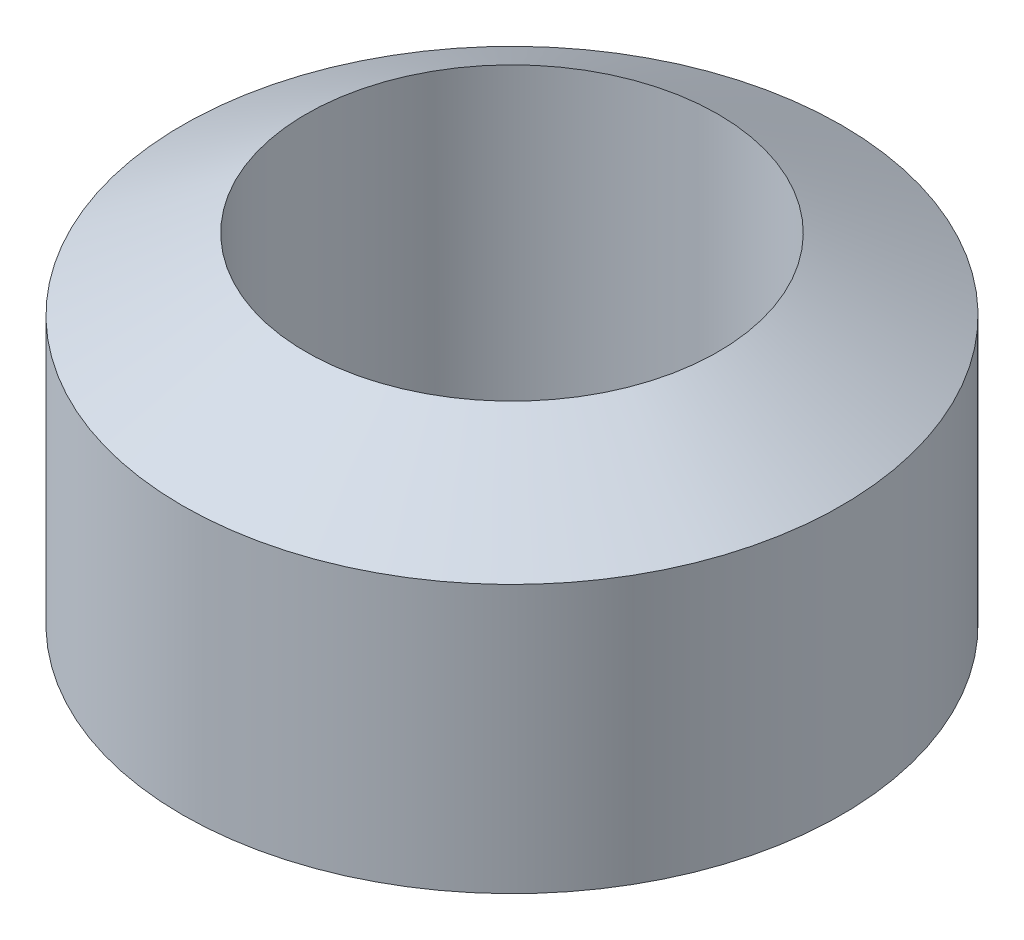
ISO-10303-21;
HEADER;
FILE_DESCRIPTION(('STEP AP214'),'2;1');
FILE_NAME('part.step','',(''),(''),'','','');
FILE_SCHEMA(('AUTOMOTIVE_DESIGN { 1 0 10303 214 1 1 1 1 }'));
ENDSEC;
DATA;
#1=APPLICATION_CONTEXT('core data for automotive mechanical design processes');
#2=APPLICATION_PROTOCOL_DEFINITION('international standard','automotive_design',2000,#1);
#3=PRODUCT_CONTEXT('',#1,'mechanical');
#4=PRODUCT('Part','Part','',(#3));
#5=PRODUCT_RELATED_PRODUCT_CATEGORY('part','',(#4));
#6=PRODUCT_DEFINITION_FORMATION('','',#4);
#7=PRODUCT_DEFINITION_CONTEXT('part definition',#1,'design');
#8=PRODUCT_DEFINITION('design','',#6,#7);
#9=PRODUCT_DEFINITION_SHAPE('','',#8);
#10=(LENGTH_UNIT() NAMED_UNIT(*) SI_UNIT(.MILLI.,.METRE.));
#11=(NAMED_UNIT(*) PLANE_ANGLE_UNIT() SI_UNIT($,.RADIAN.));
#12=(NAMED_UNIT(*) SI_UNIT($,.STERADIAN.) SOLID_ANGLE_UNIT());
#13=UNCERTAINTY_MEASURE_WITH_UNIT(LENGTH_MEASURE(1.E-05),#10,'distance_accuracy_value','');
#14=(GEOMETRIC_REPRESENTATION_CONTEXT(3) GLOBAL_UNCERTAINTY_ASSIGNED_CONTEXT((#13)) GLOBAL_UNIT_ASSIGNED_CONTEXT((#10,
#11,#12)) REPRESENTATION_CONTEXT('',''));
#15=CARTESIAN_POINT('',(0.,0.,0.));
#16=DIRECTION('',(0.,0.,1.));
#17=DIRECTION('',(1.,0.,0.));
#18=AXIS2_PLACEMENT_3D('',#15,#16,#17);
#19=CARTESIAN_POINT('',(0.,10.,0.));
#20=DIRECTION('',(0.,-1.,0.));
#21=DIRECTION('',(0.,0.,-1.));
#22=AXIS2_PLACEMENT_3D('',#19,#20,#21);
#23=CYLINDRICAL_SURFACE('',#22,8.);
#24=CARTESIAN_POINT('',(0.,1.75000000000002,0.));
#25=DIRECTION('',(0.,1.,0.));
#26=DIRECTION('',(0.,0.,1.));
#27=AXIS2_PLACEMENT_3D('',#24,#25,#26);
#28=CIRCLE('',#27,8.);
#29=CARTESIAN_POINT('',(0.,1.75000000000002,8.));
#30=VERTEX_POINT('',#29);
#31=EDGE_CURVE('E56',#30,#30,#28,.T.);
#32=ORIENTED_EDGE('',*,*,#31,.T.);
#33=EDGE_LOOP('',(#32));
#34=FACE_BOUND('',#33,.T.);
#35=CARTESIAN_POINT('',(0.,8.24999999999998,0.));
#36=DIRECTION('',(0.,1.,0.));
#37=DIRECTION('',(0.,0.,1.));
#38=AXIS2_PLACEMENT_3D('',#35,#36,#37);
#39=CIRCLE('',#38,8.);
#40=CARTESIAN_POINT('',(0.,8.24999999999998,8.));
#41=VERTEX_POINT('',#40);
#42=EDGE_CURVE('E62',#41,#41,#39,.F.);
#43=ORIENTED_EDGE('',*,*,#42,.T.);
#44=EDGE_LOOP('',(#43));
#45=FACE_BOUND('',#44,.T.);
#46=ADVANCED_FACE('F47',(#34,#45),#23,.T.);
#47=CARTESIAN_POINT('',(0.,10.,0.));
#48=DIRECTION('',(0.,-1.,0.));
#49=DIRECTION('',(0.,0.,-1.));
#50=AXIS2_PLACEMENT_3D('',#47,#48,#49);
#51=CYLINDRICAL_SURFACE('',#50,5.);
#52=CARTESIAN_POINT('',(0.,0.0179491924311604,0.));
#53=DIRECTION('',(0.,1.,0.));
#54=DIRECTION('',(0.,0.,1.));
#55=AXIS2_PLACEMENT_3D('',#52,#53,#54);
#56=CIRCLE('',#55,5.);
#57=CARTESIAN_POINT('',(0.,0.0179491924311604,5.));
#58=VERTEX_POINT('',#57);
#59=EDGE_CURVE('E10',#58,#58,#56,.F.);
#60=ORIENTED_EDGE('',*,*,#59,.T.);
#61=EDGE_LOOP('',(#60));
#62=FACE_BOUND('',#61,.T.);
#63=CARTESIAN_POINT('',(0.,9.98205080756884,0.));
#64=DIRECTION('',(0.,-1.,0.));
#65=DIRECTION('',(0.,0.,-1.));
#66=AXIS2_PLACEMENT_3D('',#63,#64,#65);
#67=CIRCLE('',#66,5.);
#68=CARTESIAN_POINT('',(0.,9.98205080756884,-5.));
#69=VERTEX_POINT('',#68);
#70=EDGE_CURVE('E68',#69,#69,#67,.F.);
#71=ORIENTED_EDGE('',*,*,#70,.T.);
#72=EDGE_LOOP('',(#71));
#73=FACE_BOUND('',#72,.T.);
#74=ADVANCED_FACE('F76',(#62,#73),#51,.F.);
#75=CARTESIAN_POINT('',(0.,10.,0.));
#76=DIRECTION('',(0.,-1.,0.));
#77=DIRECTION('',(0.,0.,-1.));
#78=AXIS2_PLACEMENT_3D('',#75,#76,#77);
#79=CONICAL_SURFACE('',#78,4.9689110867544,1.0471975511966);
#80=ORIENTED_EDGE('',*,*,#42,.F.);
#81=EDGE_LOOP('',(#80));
#82=FACE_BOUND('',#81,.T.);
#83=ORIENTED_EDGE('',*,*,#70,.F.);
#84=EDGE_LOOP('',(#83));
#85=FACE_BOUND('',#84,.T.);
#86=ADVANCED_FACE('F78',(#82,#85),#79,.T.);
#87=CARTESIAN_POINT('',(0.,1.75000000000002,0.));
#88=DIRECTION('',(0.,1.,0.));
#89=DIRECTION('',(0.,0.,1.));
#90=AXIS2_PLACEMENT_3D('',#87,#88,#89);
#91=CONICAL_SURFACE('',#90,8.,1.0471975511966);
#92=ORIENTED_EDGE('',*,*,#59,.F.);
#93=EDGE_LOOP('',(#92));
#94=FACE_BOUND('',#93,.T.);
#95=ORIENTED_EDGE('',*,*,#31,.F.);
#96=EDGE_LOOP('',(#95));
#97=FACE_BOUND('',#96,.T.);
#98=ADVANCED_FACE('F50',(#94,#97),#91,.T.);
#99=CLOSED_SHELL('',(#46,#74,#86,#98));
#100=MANIFOLD_SOLID_BREP('B2',#99);
#101=ADVANCED_BREP_SHAPE_REPRESENTATION('',(#18,#100),#14);
#102=SHAPE_DEFINITION_REPRESENTATION(#9,#101);
ENDSEC;
END-ISO-10303-21;
